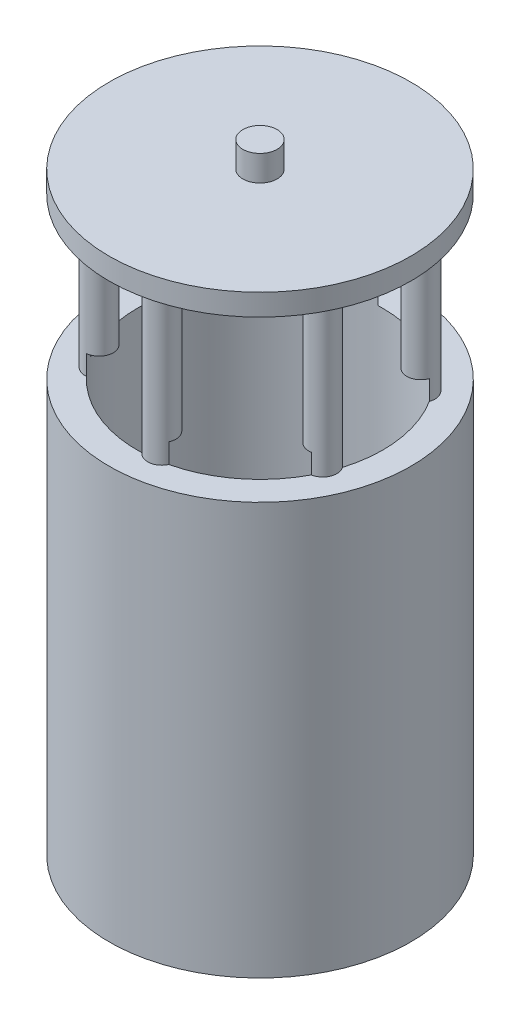
ISO-10303-21;
HEADER;
FILE_DESCRIPTION(('STEP AP214'),'2;1');
FILE_NAME('part.step','',(''),(''),'','','');
FILE_SCHEMA(('AUTOMOTIVE_DESIGN { 1 0 10303 214 1 1 1 1 }'));
ENDSEC;
DATA;
#1=APPLICATION_CONTEXT('core data for automotive mechanical design processes');
#2=APPLICATION_PROTOCOL_DEFINITION('international standard','automotive_design',2000,#1);
#3=PRODUCT_CONTEXT('',#1,'mechanical');
#4=PRODUCT('Part','Part','',(#3));
#5=PRODUCT_RELATED_PRODUCT_CATEGORY('part','',(#4));
#6=PRODUCT_DEFINITION_FORMATION('','',#4);
#7=PRODUCT_DEFINITION_CONTEXT('part definition',#1,'design');
#8=PRODUCT_DEFINITION('design','',#6,#7);
#9=PRODUCT_DEFINITION_SHAPE('','',#8);
#10=(LENGTH_UNIT() NAMED_UNIT(*) SI_UNIT(.MILLI.,.METRE.));
#11=(NAMED_UNIT(*) PLANE_ANGLE_UNIT() SI_UNIT($,.RADIAN.));
#12=(NAMED_UNIT(*) SI_UNIT($,.STERADIAN.) SOLID_ANGLE_UNIT());
#13=UNCERTAINTY_MEASURE_WITH_UNIT(LENGTH_MEASURE(1.E-05),#10,'distance_accuracy_value','');
#14=(GEOMETRIC_REPRESENTATION_CONTEXT(3) GLOBAL_UNCERTAINTY_ASSIGNED_CONTEXT((#13)) GLOBAL_UNIT_ASSIGNED_CONTEXT((#10,
#11,#12)) REPRESENTATION_CONTEXT('',''));
#15=CARTESIAN_POINT('',(0.,0.,0.));
#16=DIRECTION('',(0.,0.,1.));
#17=DIRECTION('',(1.,0.,0.));
#18=AXIS2_PLACEMENT_3D('',#15,#16,#17);
#19=CARTESIAN_POINT('',(0.,4.,0.));
#20=DIRECTION('',(0.,-1.,0.));
#21=DIRECTION('',(0.,0.,-1.));
#22=AXIS2_PLACEMENT_3D('',#19,#20,#21);
#23=CYLINDRICAL_SURFACE('',#22,27.955);
#24=CARTESIAN_POINT('',(0.,4.,0.));
#25=DIRECTION('',(0.,1.,0.));
#26=DIRECTION('',(0.,0.,1.));
#27=AXIS2_PLACEMENT_3D('',#24,#25,#26);
#28=CIRCLE('',#27,27.955);
#29=CARTESIAN_POINT('',(0.,4.,27.955));
#30=VERTEX_POINT('',#29);
#31=EDGE_CURVE('E216',#30,#30,#28,.T.);
#32=ORIENTED_EDGE('',*,*,#31,.F.);
#33=EDGE_LOOP('',(#32));
#34=FACE_BOUND('',#33,.T.);
#35=CARTESIAN_POINT('',(0.,0.,0.));
#36=DIRECTION('',(0.,1.,0.));
#37=DIRECTION('',(0.,0.,1.));
#38=AXIS2_PLACEMENT_3D('',#35,#36,#37);
#39=CIRCLE('',#38,27.955);
#40=CARTESIAN_POINT('',(0.,0.,27.955));
#41=VERTEX_POINT('',#40);
#42=EDGE_CURVE('E213',#41,#41,#39,.T.);
#43=ORIENTED_EDGE('',*,*,#42,.T.);
#44=EDGE_LOOP('',(#43));
#45=FACE_BOUND('',#44,.T.);
#46=ADVANCED_FACE('F42',(#34,#45),#23,.T.);
#47=CARTESIAN_POINT('',(0.,4.,0.));
#48=DIRECTION('',(0.,1.,0.));
#49=DIRECTION('',(0.,0.,1.));
#50=AXIS2_PLACEMENT_3D('',#47,#48,#49);
#51=PLANE('',#50);
#52=CARTESIAN_POINT('',(0.,4.,0.));
#53=DIRECTION('',(0.,1.,0.));
#54=DIRECTION('',(0.,0.,1.));
#55=AXIS2_PLACEMENT_3D('',#52,#53,#54);
#56=CIRCLE('',#55,3.175);
#57=CARTESIAN_POINT('',(0.,4.,3.175));
#58=VERTEX_POINT('',#57);
#59=EDGE_CURVE('E209',#58,#58,#56,.T.);
#60=ORIENTED_EDGE('',*,*,#59,.F.);
#61=EDGE_LOOP('',(#60));
#62=FACE_BOUND('',#61,.T.);
#63=ORIENTED_EDGE('',*,*,#31,.T.);
#64=EDGE_LOOP('',(#63));
#65=FACE_BOUND('',#64,.T.);
#66=ADVANCED_FACE('F293',(#62,#65),#51,.T.);
#67=CARTESIAN_POINT('',(0.,0.,0.));
#68=DIRECTION('',(0.,1.,0.));
#69=DIRECTION('',(0.,0.,1.));
#70=AXIS2_PLACEMENT_3D('',#67,#68,#69);
#71=PLANE('',#70);
#72=CARTESIAN_POINT('',(-19.6760805445932,0.,-8.041325393566));
#73=DIRECTION('',(0.,1.,0.));
#74=DIRECTION('',(0.,0.,1.));
#75=AXIS2_PLACEMENT_3D('',#72,#73,#74);
#76=CIRCLE('',#75,2.61531625107278);
#77=CARTESIAN_POINT('',(-19.6760805445932,0.,-5.42600914249322));
#78=VERTEX_POINT('',#77);
#79=EDGE_CURVE('E236',#78,#78,#76,.F.);
#80=ORIENTED_EDGE('',*,*,#79,.F.);
#81=EDGE_LOOP('',(#80));
#82=FACE_BOUND('',#81,.T.);
#83=CARTESIAN_POINT('',(-16.8020323432209,0.,13.0193229017444));
#84=DIRECTION('',(0.,1.,0.));
#85=DIRECTION('',(0.,0.,1.));
#86=AXIS2_PLACEMENT_3D('',#83,#84,#85);
#87=CIRCLE('',#86,2.61531625107176);
#88=CARTESIAN_POINT('',(-16.8020323432209,0.,15.6346391528161));
#89=VERTEX_POINT('',#88);
#90=EDGE_CURVE('E233',#89,#89,#87,.F.);
#91=ORIENTED_EDGE('',*,*,#90,.F.);
#92=EDGE_LOOP('',(#91));
#93=FACE_BOUND('',#92,.T.);
#94=CARTESIAN_POINT('',(2.87404820137343,0.,21.0606482953102));
#95=DIRECTION('',(0.,1.,0.));
#96=DIRECTION('',(0.,0.,1.));
#97=AXIS2_PLACEMENT_3D('',#94,#95,#96);
#98=CIRCLE('',#97,2.61531625107056);
#99=CARTESIAN_POINT('',(2.87404820137343,0.,23.6759645463808));
#100=VERTEX_POINT('',#99);
#101=EDGE_CURVE('E230',#100,#100,#98,.F.);
#102=ORIENTED_EDGE('',*,*,#101,.F.);
#103=EDGE_LOOP('',(#102));
#104=FACE_BOUND('',#103,.T.);
#105=CARTESIAN_POINT('',(19.6760805445955,0.,8.04132539356567));
#106=DIRECTION('',(0.,1.,0.));
#107=DIRECTION('',(0.,0.,1.));
#108=AXIS2_PLACEMENT_3D('',#105,#106,#107);
#109=CIRCLE('',#108,2.61531625107071);
#110=CARTESIAN_POINT('',(19.6760805445955,0.,10.6566416446364));
#111=VERTEX_POINT('',#110);
#112=EDGE_CURVE('E227',#111,#111,#109,.F.);
#113=ORIENTED_EDGE('',*,*,#112,.F.);
#114=EDGE_LOOP('',(#113));
#115=FACE_BOUND('',#114,.T.);
#116=CARTESIAN_POINT('',(16.8020323432232,0.,-13.0193229017447));
#117=DIRECTION('',(0.,1.,0.));
#118=DIRECTION('',(0.,0.,1.));
#119=AXIS2_PLACEMENT_3D('',#116,#117,#118);
#120=CIRCLE('',#119,2.61531625107183);
#121=CARTESIAN_POINT('',(16.8020323432232,0.,-10.4040066506729));
#122=VERTEX_POINT('',#121);
#123=EDGE_CURVE('E224',#122,#122,#120,.F.);
#124=ORIENTED_EDGE('',*,*,#123,.F.);
#125=EDGE_LOOP('',(#124));
#126=FACE_BOUND('',#125,.T.);
#127=CARTESIAN_POINT('',(-2.87404820137109,0.,-21.0606482953105));
#128=DIRECTION('',(0.,1.,0.));
#129=DIRECTION('',(0.,0.,1.));
#130=AXIS2_PLACEMENT_3D('',#127,#128,#129);
#131=CIRCLE('',#130,2.61531625107284);
#132=CARTESIAN_POINT('',(-2.87404820137109,0.,-18.4453320442377));
#133=VERTEX_POINT('',#132);
#134=EDGE_CURVE('E219',#133,#133,#131,.F.);
#135=ORIENTED_EDGE('',*,*,#134,.F.);
#136=EDGE_LOOP('',(#135));
#137=FACE_BOUND('',#136,.T.);
#138=ORIENTED_EDGE('',*,*,#42,.F.);
#139=EDGE_LOOP('',(#138));
#140=FACE_BOUND('',#139,.T.);
#141=ADVANCED_FACE('F298',(#82,#93,#104,#115,#126,#137,#140),#71,.F.);
#142=CARTESIAN_POINT('',(0.,8.76,0.));
#143=DIRECTION('',(0.,-1.,0.));
#144=DIRECTION('',(0.,0.,-1.));
#145=AXIS2_PLACEMENT_3D('',#142,#143,#144);
#146=CYLINDRICAL_SURFACE('',#145,3.175);
#147=CARTESIAN_POINT('',(0.,8.76,0.));
#148=DIRECTION('',(0.,1.,0.));
#149=DIRECTION('',(0.,0.,1.));
#150=AXIS2_PLACEMENT_3D('',#147,#148,#149);
#151=CIRCLE('',#150,3.175);
#152=CARTESIAN_POINT('',(0.,8.76,3.175));
#153=VERTEX_POINT('',#152);
#154=EDGE_CURVE('E210',#153,#153,#151,.T.);
#155=ORIENTED_EDGE('',*,*,#154,.F.);
#156=EDGE_LOOP('',(#155));
#157=FACE_BOUND('',#156,.T.);
#158=ORIENTED_EDGE('',*,*,#59,.T.);
#159=EDGE_LOOP('',(#158));
#160=FACE_BOUND('',#159,.T.);
#161=ADVANCED_FACE('F306',(#157,#160),#146,.T.);
#162=CARTESIAN_POINT('',(0.,8.76,0.));
#163=DIRECTION('',(0.,1.,0.));
#164=DIRECTION('',(0.,0.,1.));
#165=AXIS2_PLACEMENT_3D('',#162,#163,#164);
#166=PLANE('',#165);
#167=ORIENTED_EDGE('',*,*,#154,.T.);
#168=EDGE_LOOP('',(#167));
#169=FACE_BOUND('',#168,.T.);
#170=ADVANCED_FACE('F311',(#169),#166,.T.);
#171=CARTESIAN_POINT('',(-2.87404820137109,-29.718,-21.0606482953105));
#172=DIRECTION('',(0.,1.,0.));
#173=DIRECTION('',(0.,0.,1.));
#174=AXIS2_PLACEMENT_3D('',#171,#172,#173);
#175=CYLINDRICAL_SURFACE('',#174,2.61531625107284);
#176=CARTESIAN_POINT('',(-2.87404820137109,-26.068,-21.0606482953105));
#177=DIRECTION('',(0.,-1.,0.));
#178=DIRECTION('',(0.,0.,-1.));
#179=AXIS2_PLACEMENT_3D('',#176,#177,#178);
#180=CIRCLE('',#179,2.61531625107284);
#181=CARTESIAN_POINT('',(-0.870881883741702,-26.068,-22.7420773889807));
#182=VERTEX_POINT('',#181);
#183=CARTESIAN_POINT('',(-5.25449300599682,-26.068,-22.1438664752059));
#184=VERTEX_POINT('',#183);
#185=EDGE_CURVE('E135',#182,#184,#180,.T.);
#186=ORIENTED_EDGE('',*,*,#185,.F.);
#187=DIRECTION('',(0.,-1.,0.));
#188=VECTOR('',#187,1.);
#189=CARTESIAN_POINT('',(-0.870881883741677,-66.068,-22.7420773889808));
#190=LINE('',#189,#188);
#191=CARTESIAN_POINT('',(-0.870881883741677,-29.718,-22.7420773889808));
#192=VERTEX_POINT('',#191);
#193=EDGE_CURVE('E148',#182,#192,#190,.T.);
#194=ORIENTED_EDGE('',*,*,#193,.T.);
#195=CARTESIAN_POINT('',(-2.87404820137109,-29.718,-21.0606482953105));
#196=DIRECTION('',(0.,-1.,0.));
#197=DIRECTION('',(0.,0.,-1.));
#198=AXIS2_PLACEMENT_3D('',#195,#196,#197);
#199=CIRCLE('',#198,2.61531625107284);
#200=CARTESIAN_POINT('',(-5.25449300599685,-29.718,-22.1438664752059));
#201=VERTEX_POINT('',#200);
#202=EDGE_CURVE('E206',#201,#192,#199,.T.);
#203=ORIENTED_EDGE('',*,*,#202,.F.);
#204=DIRECTION('',(0.,-1.,0.));
#205=VECTOR('',#204,1.);
#206=CARTESIAN_POINT('',(-5.25449300599685,-66.068,-22.1438664752059));
#207=LINE('',#206,#205);
#208=EDGE_CURVE('E158',#201,#184,#207,.F.);
#209=ORIENTED_EDGE('',*,*,#208,.T.);
#210=EDGE_LOOP('',(#186,#194,#203,#209));
#211=FACE_BOUND('',#210,.T.);
#212=ORIENTED_EDGE('',*,*,#134,.T.);
#213=EDGE_LOOP('',(#212));
#214=FACE_BOUND('',#213,.T.);
#215=ADVANCED_FACE('F319',(#211,#214),#175,.T.);
#216=CARTESIAN_POINT('',(16.8020323432232,-29.718,-13.0193229017447));
#217=DIRECTION('',(0.,1.,0.));
#218=DIRECTION('',(0.,0.,1.));
#219=AXIS2_PLACEMENT_3D('',#216,#217,#218);
#220=CYLINDRICAL_SURFACE('',#219,2.61531625107183);
#221=CARTESIAN_POINT('',(16.8020323432232,-26.068,-13.0193229017447));
#222=DIRECTION('',(0.,-1.,0.));
#223=DIRECTION('',(0.,0.,-1.));
#224=AXIS2_PLACEMENT_3D('',#221,#222,#223);
#225=CIRCLE('',#224,2.61531625107183);
#226=CARTESIAN_POINT('',(19.2597758118175,-26.068,-12.1252445295074));
#227=VERTEX_POINT('',#226);
#228=CARTESIAN_POINT('',(16.5499044025405,-26.068,-15.6224576648039));
#229=VERTEX_POINT('',#228);
#230=EDGE_CURVE('E130',#227,#229,#225,.T.);
#231=ORIENTED_EDGE('',*,*,#230,.F.);
#232=DIRECTION('',(0.,-1.,0.));
#233=VECTOR('',#232,1.);
#234=CARTESIAN_POINT('',(19.2597758118175,-66.068,-12.1252445295073));
#235=LINE('',#234,#233);
#236=CARTESIAN_POINT('',(19.2597758118175,-29.718,-12.1252445295073));
#237=VERTEX_POINT('',#236);
#238=EDGE_CURVE('E139',#227,#237,#235,.T.);
#239=ORIENTED_EDGE('',*,*,#238,.T.);
#240=CARTESIAN_POINT('',(16.8020323432232,-29.718,-13.0193229017447));
#241=DIRECTION('',(0.,-1.,0.));
#242=DIRECTION('',(0.,0.,-1.));
#243=AXIS2_PLACEMENT_3D('',#240,#241,#242);
#244=CIRCLE('',#243,2.61531625107183);
#245=CARTESIAN_POINT('',(16.5499044025405,-29.718,-15.6224576648039));
#246=VERTEX_POINT('',#245);
#247=EDGE_CURVE('E147',#246,#237,#244,.T.);
#248=ORIENTED_EDGE('',*,*,#247,.F.);
#249=DIRECTION('',(0.,-1.,0.));
#250=VECTOR('',#249,1.);
#251=CARTESIAN_POINT('',(16.5499044025405,-66.068,-15.6224576648039));
#252=LINE('',#251,#250);
#253=EDGE_CURVE('E56',#246,#229,#252,.F.);
#254=ORIENTED_EDGE('',*,*,#253,.T.);
#255=EDGE_LOOP('',(#231,#239,#248,#254));
#256=FACE_BOUND('',#255,.T.);
#257=ORIENTED_EDGE('',*,*,#123,.T.);
#258=EDGE_LOOP('',(#257));
#259=FACE_BOUND('',#258,.T.);
#260=ADVANCED_FACE('F144',(#256,#259),#220,.T.);
#261=CARTESIAN_POINT('',(19.6760805445955,-29.718,8.04132539356567));
#262=DIRECTION('',(0.,1.,0.));
#263=DIRECTION('',(0.,0.,1.));
#264=AXIS2_PLACEMENT_3D('',#261,#262,#263);
#265=CYLINDRICAL_SURFACE('',#264,2.61531625107071);
#266=CARTESIAN_POINT('',(19.6760805445955,-26.068,8.04132539356567));
#267=DIRECTION('',(0.,-1.,0.));
#268=DIRECTION('',(0.,0.,-1.));
#269=AXIS2_PLACEMENT_3D('',#266,#267,#268);
#270=CIRCLE('',#269,2.61531625107071);
#271=CARTESIAN_POINT('',(20.1306576955617,-26.068,10.6168328594709));
#272=VERTEX_POINT('',#271);
#273=CARTESIAN_POINT('',(21.8043974085373,-26.068,6.52140881040218));
#274=VERTEX_POINT('',#273);
#275=EDGE_CURVE('E136',#272,#274,#270,.T.);
#276=ORIENTED_EDGE('',*,*,#275,.F.);
#277=DIRECTION('',(0.,-1.,0.));
#278=VECTOR('',#277,1.);
#279=CARTESIAN_POINT('',(20.1306576955617,-66.068,10.616832859471));
#280=LINE('',#279,#278);
#281=CARTESIAN_POINT('',(20.1306576955617,-29.718,10.616832859471));
#282=VERTEX_POINT('',#281);
#283=EDGE_CURVE('E176',#272,#282,#280,.T.);
#284=ORIENTED_EDGE('',*,*,#283,.T.);
#285=CARTESIAN_POINT('',(19.6760805445955,-29.718,8.04132539356567));
#286=DIRECTION('',(0.,-1.,0.));
#287=DIRECTION('',(0.,0.,-1.));
#288=AXIS2_PLACEMENT_3D('',#285,#286,#287);
#289=CIRCLE('',#288,2.61531625107071);
#290=CARTESIAN_POINT('',(21.8043974085373,-29.718,6.52140881040214));
#291=VERTEX_POINT('',#290);
#292=EDGE_CURVE('E202',#291,#282,#289,.T.);
#293=ORIENTED_EDGE('',*,*,#292,.F.);
#294=DIRECTION('',(0.,-1.,0.));
#295=VECTOR('',#294,1.);
#296=CARTESIAN_POINT('',(21.8043974085373,-66.068,6.52140881040214));
#297=LINE('',#296,#295);
#298=EDGE_CURVE('E63',#291,#274,#297,.F.);
#299=ORIENTED_EDGE('',*,*,#298,.T.);
#300=EDGE_LOOP('',(#276,#284,#293,#299));
#301=FACE_BOUND('',#300,.T.);
#302=ORIENTED_EDGE('',*,*,#112,.T.);
#303=EDGE_LOOP('',(#302));
#304=FACE_BOUND('',#303,.T.);
#305=ADVANCED_FACE('F326',(#301,#304),#265,.T.);
#306=CARTESIAN_POINT('',(2.87404820137343,-29.718,21.0606482953102));
#307=DIRECTION('',(0.,1.,0.));
#308=DIRECTION('',(0.,0.,1.));
#309=AXIS2_PLACEMENT_3D('',#306,#307,#308);
#310=CYLINDRICAL_SURFACE('',#309,2.61531625107056);
#311=CARTESIAN_POINT('',(2.87404820137343,-26.068,21.0606482953102));
#312=DIRECTION('',(0.,-1.,0.));
#313=DIRECTION('',(0.,0.,-1.));
#314=AXIS2_PLACEMENT_3D('',#311,#312,#313);
#315=CIRCLE('',#314,2.61531625107056);
#316=CARTESIAN_POINT('',(0.870881883747082,-26.068,22.7420773889805));
#317=VERTEX_POINT('',#316);
#318=CARTESIAN_POINT('',(5.2544930059965,-26.068,22.143866475206));
#319=VERTEX_POINT('',#318);
#320=EDGE_CURVE('E183',#317,#319,#315,.T.);
#321=ORIENTED_EDGE('',*,*,#320,.F.);
#322=DIRECTION('',(0.,-1.,0.));
#323=VECTOR('',#322,1.);
#324=CARTESIAN_POINT('',(0.870881883747086,-66.068,22.7420773889805));
#325=LINE('',#324,#323);
#326=CARTESIAN_POINT('',(0.870881883747086,-29.718,22.7420773889805));
#327=VERTEX_POINT('',#326);
#328=EDGE_CURVE('E170',#317,#327,#325,.T.);
#329=ORIENTED_EDGE('',*,*,#328,.T.);
#330=CARTESIAN_POINT('',(2.87404820137343,-29.718,21.0606482953102));
#331=DIRECTION('',(0.,-1.,0.));
#332=DIRECTION('',(0.,0.,-1.));
#333=AXIS2_PLACEMENT_3D('',#330,#331,#332);
#334=CIRCLE('',#333,2.61531625107056);
#335=CARTESIAN_POINT('',(5.2544930059965,-29.718,22.143866475206));
#336=VERTEX_POINT('',#335);
#337=EDGE_CURVE('E199',#336,#327,#334,.T.);
#338=ORIENTED_EDGE('',*,*,#337,.F.);
#339=DIRECTION('',(0.,-1.,0.));
#340=VECTOR('',#339,1.);
#341=CARTESIAN_POINT('',(5.2544930059965,-66.068,22.143866475206));
#342=LINE('',#341,#340);
#343=EDGE_CURVE('E173',#336,#319,#342,.F.);
#344=ORIENTED_EDGE('',*,*,#343,.T.);
#345=EDGE_LOOP('',(#321,#329,#338,#344));
#346=FACE_BOUND('',#345,.T.);
#347=ORIENTED_EDGE('',*,*,#101,.T.);
#348=EDGE_LOOP('',(#347));
#349=FACE_BOUND('',#348,.T.);
#350=ADVANCED_FACE('F329',(#346,#349),#310,.T.);
#351=CARTESIAN_POINT('',(-16.8020323432209,-29.718,13.0193229017444));
#352=DIRECTION('',(0.,1.,0.));
#353=DIRECTION('',(0.,0.,1.));
#354=AXIS2_PLACEMENT_3D('',#351,#352,#353);
#355=CYLINDRICAL_SURFACE('',#354,2.61531625107176);
#356=CARTESIAN_POINT('',(-16.8020323432209,-26.068,13.0193229017444));
#357=DIRECTION('',(0.,-1.,0.));
#358=DIRECTION('',(0.,0.,-1.));
#359=AXIS2_PLACEMENT_3D('',#356,#357,#358);
#360=CIRCLE('',#359,2.61531625107176);
#361=CARTESIAN_POINT('',(-19.2597758118161,-26.068,12.1252445295096));
#362=VERTEX_POINT('',#361);
#363=CARTESIAN_POINT('',(-16.5499044025406,-26.068,15.6224576648038));
#364=VERTEX_POINT('',#363);
#365=EDGE_CURVE('E181',#362,#364,#360,.T.);
#366=ORIENTED_EDGE('',*,*,#365,.F.);
#367=DIRECTION('',(0.,-1.,0.));
#368=VECTOR('',#367,1.);
#369=CARTESIAN_POINT('',(-19.2597758118161,-66.068,12.1252445295096));
#370=LINE('',#369,#368);
#371=CARTESIAN_POINT('',(-19.2597758118161,-29.718,12.1252445295096));
#372=VERTEX_POINT('',#371);
#373=EDGE_CURVE('E164',#362,#372,#370,.T.);
#374=ORIENTED_EDGE('',*,*,#373,.T.);
#375=CARTESIAN_POINT('',(-16.8020323432209,-29.718,13.0193229017444));
#376=DIRECTION('',(0.,-1.,0.));
#377=DIRECTION('',(0.,0.,-1.));
#378=AXIS2_PLACEMENT_3D('',#375,#376,#377);
#379=CIRCLE('',#378,2.61531625107176);
#380=CARTESIAN_POINT('',(-16.5499044025406,-29.718,15.6224576648038));
#381=VERTEX_POINT('',#380);
#382=EDGE_CURVE('E196',#381,#372,#379,.T.);
#383=ORIENTED_EDGE('',*,*,#382,.F.);
#384=DIRECTION('',(0.,-1.,0.));
#385=VECTOR('',#384,1.);
#386=CARTESIAN_POINT('',(-16.5499044025406,-66.068,15.6224576648038));
#387=LINE('',#386,#385);
#388=EDGE_CURVE('E167',#381,#364,#387,.F.);
#389=ORIENTED_EDGE('',*,*,#388,.T.);
#390=EDGE_LOOP('',(#366,#374,#383,#389));
#391=FACE_BOUND('',#390,.T.);
#392=ORIENTED_EDGE('',*,*,#90,.T.);
#393=EDGE_LOOP('',(#392));
#394=FACE_BOUND('',#393,.T.);
#395=ADVANCED_FACE('F333',(#391,#394),#355,.T.);
#396=CARTESIAN_POINT('',(-19.6760805445932,-29.718,-8.041325393566));
#397=DIRECTION('',(0.,1.,0.));
#398=DIRECTION('',(0.,0.,1.));
#399=AXIS2_PLACEMENT_3D('',#396,#397,#398);
#400=CYLINDRICAL_SURFACE('',#399,2.61531625107278);
#401=CARTESIAN_POINT('',(-19.6760805445932,-26.068,-8.041325393566));
#402=DIRECTION('',(0.,-1.,0.));
#403=DIRECTION('',(0.,0.,-1.));
#404=AXIS2_PLACEMENT_3D('',#401,#402,#403);
#405=CIRCLE('',#404,2.61531625107278);
#406=CARTESIAN_POINT('',(-20.1306576955605,-26.068,-10.6168328594732));
#407=VERTEX_POINT('',#406);
#408=CARTESIAN_POINT('',(-21.8043974085373,-26.068,-6.52140881040215));
#409=VERTEX_POINT('',#408);
#410=EDGE_CURVE('E11',#407,#409,#405,.T.);
#411=ORIENTED_EDGE('',*,*,#410,.F.);
#412=DIRECTION('',(0.,-1.,0.));
#413=VECTOR('',#412,1.);
#414=CARTESIAN_POINT('',(-20.1306576955605,-66.068,-10.6168328594732));
#415=LINE('',#414,#413);
#416=CARTESIAN_POINT('',(-20.1306576955605,-29.718,-10.6168328594732));
#417=VERTEX_POINT('',#416);
#418=EDGE_CURVE('E151',#407,#417,#415,.T.);
#419=ORIENTED_EDGE('',*,*,#418,.T.);
#420=CARTESIAN_POINT('',(-19.6760805445932,-29.718,-8.041325393566));
#421=DIRECTION('',(0.,-1.,0.));
#422=DIRECTION('',(0.,0.,-1.));
#423=AXIS2_PLACEMENT_3D('',#420,#421,#422);
#424=CIRCLE('',#423,2.61531625107278);
#425=CARTESIAN_POINT('',(-21.8043974085373,-29.718,-6.52140881040217));
#426=VERTEX_POINT('',#425);
#427=EDGE_CURVE('E191',#426,#417,#424,.T.);
#428=ORIENTED_EDGE('',*,*,#427,.F.);
#429=DIRECTION('',(0.,-1.,0.));
#430=VECTOR('',#429,1.);
#431=CARTESIAN_POINT('',(-21.8043974085373,-66.068,-6.52140881040217));
#432=LINE('',#431,#430);
#433=EDGE_CURVE('E161',#426,#409,#432,.F.);
#434=ORIENTED_EDGE('',*,*,#433,.T.);
#435=EDGE_LOOP('',(#411,#419,#428,#434));
#436=FACE_BOUND('',#435,.T.);
#437=ORIENTED_EDGE('',*,*,#79,.T.);
#438=EDGE_LOOP('',(#437));
#439=FACE_BOUND('',#438,.T.);
#440=ADVANCED_FACE('F256',(#436,#439),#400,.T.);
#441=CARTESIAN_POINT('',(0.,-106.068,0.));
#442=DIRECTION('',(0.,1.,0.));
#443=DIRECTION('',(0.,0.,1.));
#444=AXIS2_PLACEMENT_3D('',#441,#442,#443);
#445=CYLINDRICAL_SURFACE('',#444,27.955);
#446=CARTESIAN_POINT('',(0.,-106.068,0.));
#447=DIRECTION('',(0.,-1.,0.));
#448=DIRECTION('',(0.,0.,-1.));
#449=AXIS2_PLACEMENT_3D('',#446,#447,#448);
#450=CIRCLE('',#449,27.955);
#451=CARTESIAN_POINT('',(0.,-106.068,-27.955));
#452=VERTEX_POINT('',#451);
#453=EDGE_CURVE('E188',#452,#452,#450,.T.);
#454=ORIENTED_EDGE('',*,*,#453,.F.);
#455=EDGE_LOOP('',(#454));
#456=FACE_BOUND('',#455,.T.);
#457=CARTESIAN_POINT('',(0.,-29.718,0.));
#458=DIRECTION('',(0.,-1.,0.));
#459=DIRECTION('',(0.,0.,-1.));
#460=AXIS2_PLACEMENT_3D('',#457,#458,#459);
#461=CIRCLE('',#460,27.955);
#462=CARTESIAN_POINT('',(0.,-29.718,-27.955));
#463=VERTEX_POINT('',#462);
#464=EDGE_CURVE('E187',#463,#463,#461,.T.);
#465=ORIENTED_EDGE('',*,*,#464,.T.);
#466=EDGE_LOOP('',(#465));
#467=FACE_BOUND('',#466,.T.);
#468=ADVANCED_FACE('F277',(#456,#467),#445,.T.);
#469=CARTESIAN_POINT('',(0.,-106.068,0.));
#470=DIRECTION('',(0.,-1.,0.));
#471=DIRECTION('',(0.,0.,-1.));
#472=AXIS2_PLACEMENT_3D('',#469,#470,#471);
#473=PLANE('',#472);
#474=CARTESIAN_POINT('',(0.,-106.068,0.));
#475=DIRECTION('',(0.,-1.,0.));
#476=DIRECTION('',(0.,0.,-1.));
#477=AXIS2_PLACEMENT_3D('',#474,#475,#476);
#478=CIRCLE('',#477,22.7587459940529);
#479=CARTESIAN_POINT('',(0.,-106.068,-22.7587459940529));
#480=VERTEX_POINT('',#479);
#481=EDGE_CURVE('E154',#480,#480,#478,.T.);
#482=ORIENTED_EDGE('',*,*,#481,.F.);
#483=EDGE_LOOP('',(#482));
#484=FACE_BOUND('',#483,.T.);
#485=ORIENTED_EDGE('',*,*,#453,.T.);
#486=EDGE_LOOP('',(#485));
#487=FACE_BOUND('',#486,.T.);
#488=ADVANCED_FACE('F274',(#484,#487),#473,.T.);
#489=CARTESIAN_POINT('',(0.,-29.718,0.));
#490=DIRECTION('',(0.,-1.,0.));
#491=DIRECTION('',(0.,0.,-1.));
#492=AXIS2_PLACEMENT_3D('',#489,#490,#491);
#493=PLANE('',#492);
#494=ORIENTED_EDGE('',*,*,#247,.T.);
#495=CARTESIAN_POINT('',(0.,-29.718,0.));
#496=DIRECTION('',(0.,-1.,0.));
#497=DIRECTION('',(0.,0.,-1.));
#498=AXIS2_PLACEMENT_3D('',#495,#496,#497);
#499=CIRCLE('',#498,22.7587459940529);
#500=EDGE_CURVE('E49',#237,#291,#499,.T.);
#501=ORIENTED_EDGE('',*,*,#500,.T.);
#502=ORIENTED_EDGE('',*,*,#292,.T.);
#503=EDGE_CURVE('E243',#282,#336,#499,.T.);
#504=ORIENTED_EDGE('',*,*,#503,.T.);
#505=ORIENTED_EDGE('',*,*,#337,.T.);
#506=EDGE_CURVE('E246',#327,#381,#499,.T.);
#507=ORIENTED_EDGE('',*,*,#506,.T.);
#508=ORIENTED_EDGE('',*,*,#382,.T.);
#509=EDGE_CURVE('E242',#372,#426,#499,.T.);
#510=ORIENTED_EDGE('',*,*,#509,.T.);
#511=ORIENTED_EDGE('',*,*,#427,.T.);
#512=EDGE_CURVE('E239',#417,#201,#499,.T.);
#513=ORIENTED_EDGE('',*,*,#512,.T.);
#514=ORIENTED_EDGE('',*,*,#202,.T.);
#515=EDGE_CURVE('E238',#192,#246,#499,.T.);
#516=ORIENTED_EDGE('',*,*,#515,.T.);
#517=EDGE_LOOP('',(#494,#501,#502,#504,#505,#507,#508,#510,#511,#513,#514,#516));
#518=FACE_BOUND('',#517,.T.);
#519=ORIENTED_EDGE('',*,*,#464,.F.);
#520=EDGE_LOOP('',(#519));
#521=FACE_BOUND('',#520,.T.);
#522=ADVANCED_FACE('F252',(#518,#521),#493,.F.);
#523=CARTESIAN_POINT('',(0.,-26.068,0.));
#524=DIRECTION('',(0.,-1.,0.));
#525=DIRECTION('',(0.,0.,-1.));
#526=AXIS2_PLACEMENT_3D('',#523,#524,#525);
#527=PLANE('',#526);
#528=ORIENTED_EDGE('',*,*,#185,.T.);
#529=CARTESIAN_POINT('',(0.,-26.068,0.));
#530=DIRECTION('',(0.,-1.,0.));
#531=DIRECTION('',(0.,0.,-1.));
#532=AXIS2_PLACEMENT_3D('',#529,#530,#531);
#533=CIRCLE('',#532,22.7587459940529);
#534=EDGE_CURVE('E142',#184,#182,#533,.T.);
#535=ORIENTED_EDGE('',*,*,#534,.T.);
#536=EDGE_LOOP('',(#528,#535));
#537=FACE_BOUND('',#536,.T.);
#538=ADVANCED_FACE('F286',(#537),#527,.T.);
#539=ORIENTED_EDGE('',*,*,#230,.T.);
#540=EDGE_CURVE('E132',#229,#227,#533,.T.);
#541=ORIENTED_EDGE('',*,*,#540,.T.);
#542=EDGE_LOOP('',(#539,#541));
#543=FACE_BOUND('',#542,.T.);
#544=ADVANCED_FACE('F131',(#543),#527,.T.);
#545=ORIENTED_EDGE('',*,*,#275,.T.);
#546=EDGE_CURVE('E140',#274,#272,#533,.T.);
#547=ORIENTED_EDGE('',*,*,#546,.T.);
#548=EDGE_LOOP('',(#545,#547));
#549=FACE_BOUND('',#548,.T.);
#550=ADVANCED_FACE('F374',(#549),#527,.T.);
#551=ORIENTED_EDGE('',*,*,#320,.T.);
#552=EDGE_CURVE('E265',#319,#317,#533,.T.);
#553=ORIENTED_EDGE('',*,*,#552,.T.);
#554=EDGE_LOOP('',(#551,#553));
#555=FACE_BOUND('',#554,.T.);
#556=ADVANCED_FACE('F383',(#555),#527,.T.);
#557=ORIENTED_EDGE('',*,*,#365,.T.);
#558=EDGE_CURVE('E263',#364,#362,#533,.T.);
#559=ORIENTED_EDGE('',*,*,#558,.T.);
#560=EDGE_LOOP('',(#557,#559));
#561=FACE_BOUND('',#560,.T.);
#562=ADVANCED_FACE('F393',(#561),#527,.T.);
#563=ORIENTED_EDGE('',*,*,#410,.T.);
#564=EDGE_CURVE('E260',#409,#407,#533,.T.);
#565=ORIENTED_EDGE('',*,*,#564,.T.);
#566=EDGE_LOOP('',(#563,#565));
#567=FACE_BOUND('',#566,.T.);
#568=ADVANCED_FACE('F262',(#567),#527,.T.);
#569=CARTESIAN_POINT('',(0.,-26.068,0.));
#570=DIRECTION('',(0.,-1.,0.));
#571=DIRECTION('',(0.,0.,-1.));
#572=AXIS2_PLACEMENT_3D('',#569,#570,#571);
#573=CYLINDRICAL_SURFACE('',#572,22.7587459940529);
#574=ORIENTED_EDGE('',*,*,#481,.T.);
#575=EDGE_LOOP('',(#574));
#576=FACE_BOUND('',#575,.T.);
#577=ORIENTED_EDGE('',*,*,#540,.F.);
#578=ORIENTED_EDGE('',*,*,#253,.F.);
#579=ORIENTED_EDGE('',*,*,#515,.F.);
#580=ORIENTED_EDGE('',*,*,#193,.F.);
#581=ORIENTED_EDGE('',*,*,#534,.F.);
#582=ORIENTED_EDGE('',*,*,#208,.F.);
#583=ORIENTED_EDGE('',*,*,#512,.F.);
#584=ORIENTED_EDGE('',*,*,#418,.F.);
#585=ORIENTED_EDGE('',*,*,#564,.F.);
#586=ORIENTED_EDGE('',*,*,#433,.F.);
#587=ORIENTED_EDGE('',*,*,#509,.F.);
#588=ORIENTED_EDGE('',*,*,#373,.F.);
#589=ORIENTED_EDGE('',*,*,#558,.F.);
#590=ORIENTED_EDGE('',*,*,#388,.F.);
#591=ORIENTED_EDGE('',*,*,#506,.F.);
#592=ORIENTED_EDGE('',*,*,#328,.F.);
#593=ORIENTED_EDGE('',*,*,#552,.F.);
#594=ORIENTED_EDGE('',*,*,#343,.F.);
#595=ORIENTED_EDGE('',*,*,#503,.F.);
#596=ORIENTED_EDGE('',*,*,#283,.F.);
#597=ORIENTED_EDGE('',*,*,#546,.F.);
#598=ORIENTED_EDGE('',*,*,#298,.F.);
#599=ORIENTED_EDGE('',*,*,#500,.F.);
#600=ORIENTED_EDGE('',*,*,#238,.F.);
#601=EDGE_LOOP('',(#577,#578,#579,#580,#581,#582,#583,#584,#585,#586,#587,#588,#589,#590,#591,
#592,#593,#594,#595,#596,#597,#598,#599,#600));
#602=FACE_BOUND('',#601,.T.);
#603=ADVANCED_FACE('F138',(#576,#602),#573,.F.);
#604=CLOSED_SHELL('',(#46,#66,#141,#161,#170,#215,#260,#305,#350,#395,#440,#468,#488,#522,#538,
#544,#550,#556,#562,#568,#603));
#605=MANIFOLD_SOLID_BREP('B2',#604);
#606=ADVANCED_BREP_SHAPE_REPRESENTATION('',(#18,#605),#14);
#607=SHAPE_DEFINITION_REPRESENTATION(#9,#606);
ENDSEC;
END-ISO-10303-21;
